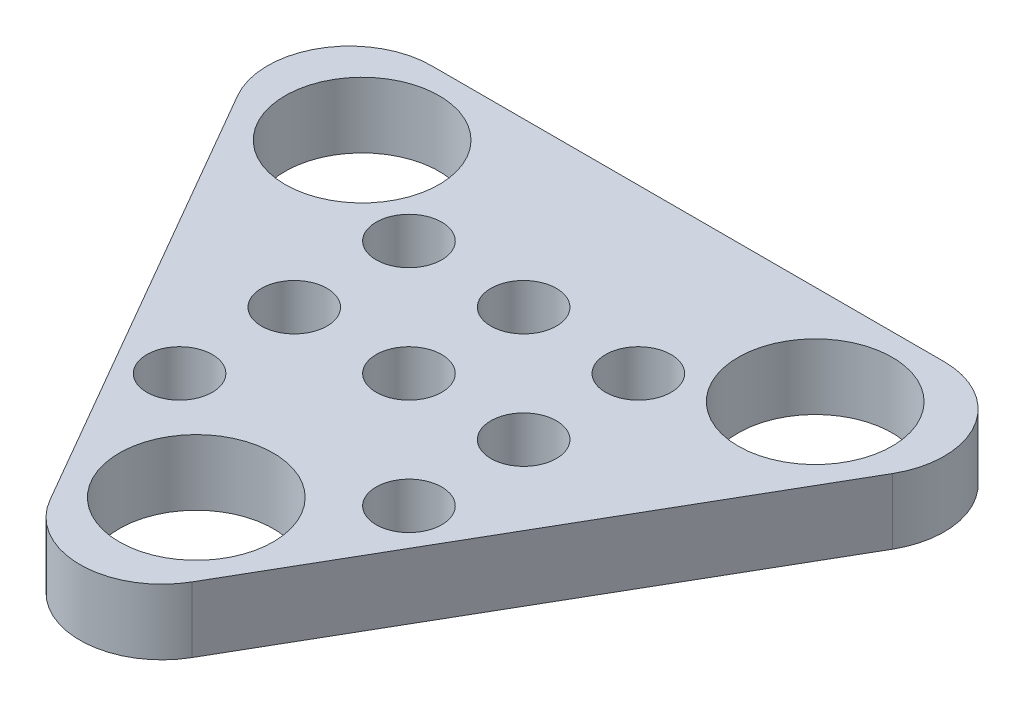
ISO-10303-21;
HEADER;
FILE_DESCRIPTION(('STEP AP214'),'2;1');
FILE_NAME('part.step','',(''),(''),'','','');
FILE_SCHEMA(('AUTOMOTIVE_DESIGN { 1 0 10303 214 1 1 1 1 }'));
ENDSEC;
DATA;
#1=APPLICATION_CONTEXT('core data for automotive mechanical design processes');
#2=APPLICATION_PROTOCOL_DEFINITION('international standard','automotive_design',2000,#1);
#3=PRODUCT_CONTEXT('',#1,'mechanical');
#4=PRODUCT('Part','Part','',(#3));
#5=PRODUCT_RELATED_PRODUCT_CATEGORY('part','',(#4));
#6=PRODUCT_DEFINITION_FORMATION('','',#4);
#7=PRODUCT_DEFINITION_CONTEXT('part definition',#1,'design');
#8=PRODUCT_DEFINITION('design','',#6,#7);
#9=PRODUCT_DEFINITION_SHAPE('','',#8);
#10=(LENGTH_UNIT() NAMED_UNIT(*) SI_UNIT(.MILLI.,.METRE.));
#11=(NAMED_UNIT(*) PLANE_ANGLE_UNIT() SI_UNIT($,.RADIAN.));
#12=(NAMED_UNIT(*) SI_UNIT($,.STERADIAN.) SOLID_ANGLE_UNIT());
#13=UNCERTAINTY_MEASURE_WITH_UNIT(LENGTH_MEASURE(1.E-05),#10,'distance_accuracy_value','');
#14=(GEOMETRIC_REPRESENTATION_CONTEXT(3) GLOBAL_UNCERTAINTY_ASSIGNED_CONTEXT((#13)) GLOBAL_UNIT_ASSIGNED_CONTEXT((#10,
#11,#12)) REPRESENTATION_CONTEXT('',''));
#15=CARTESIAN_POINT('',(0.,0.,0.));
#16=DIRECTION('',(0.,0.,1.));
#17=DIRECTION('',(1.,0.,0.));
#18=AXIS2_PLACEMENT_3D('',#15,#16,#17);
#19=CARTESIAN_POINT('',(-3.0209776379957,2.,-4.56619239929004));
#20=DIRECTION('',(0.,-1.,0.));
#21=DIRECTION('',(0.,0.,-1.));
#22=AXIS2_PLACEMENT_3D('',#19,#20,#21);
#23=PLANE('',#22);
#24=CARTESIAN_POINT('',(1.27033463203907,2.,4.91139789499105));
#25=DIRECTION('',(0.,1.,0.));
#26=DIRECTION('',(0.,0.,1.));
#27=AXIS2_PLACEMENT_3D('',#24,#25,#26);
#28=CIRCLE('',#27,0.999999999999769);
#29=CARTESIAN_POINT('',(1.27033463203907,2.,5.91139789499082));
#30=VERTEX_POINT('',#29);
#31=EDGE_CURVE('E216',#30,#30,#28,.T.);
#32=ORIENTED_EDGE('',*,*,#31,.F.);
#33=EDGE_LOOP('',(#32));
#34=FACE_BOUND('',#33,.T.);
#35=CARTESIAN_POINT('',(4.77033463203904,2.,1.41139789499105));
#36=DIRECTION('',(0.,1.,0.));
#37=DIRECTION('',(0.,0.,1.));
#38=AXIS2_PLACEMENT_3D('',#35,#36,#37);
#39=CIRCLE('',#38,0.999999999999769);
#40=CARTESIAN_POINT('',(4.77033463203904,2.,2.41139789499082));
#41=VERTEX_POINT('',#40);
#42=EDGE_CURVE('E228',#41,#41,#39,.T.);
#43=ORIENTED_EDGE('',*,*,#42,.F.);
#44=EDGE_LOOP('',(#43));
#45=FACE_BOUND('',#44,.T.);
#46=CARTESIAN_POINT('',(8.270334632039,2.,-2.08860210500895));
#47=DIRECTION('',(0.,1.,0.));
#48=DIRECTION('',(0.,0.,1.));
#49=AXIS2_PLACEMENT_3D('',#46,#47,#48);
#50=CIRCLE('',#49,0.999999999999769);
#51=CARTESIAN_POINT('',(8.270334632039,2.,-1.08860210500918));
#52=VERTEX_POINT('',#51);
#53=EDGE_CURVE('E240',#52,#52,#50,.T.);
#54=ORIENTED_EDGE('',*,*,#53,.F.);
#55=EDGE_LOOP('',(#54));
#56=FACE_BOUND('',#55,.T.);
#57=CARTESIAN_POINT('',(1.270334632039,2.,-2.08860210500895));
#58=DIRECTION('',(0.,1.,0.));
#59=DIRECTION('',(0.,0.,1.));
#60=AXIS2_PLACEMENT_3D('',#57,#58,#59);
#61=CIRCLE('',#60,0.999999999999769);
#62=CARTESIAN_POINT('',(1.270334632039,2.,-1.08860210500918));
#63=VERTEX_POINT('',#62);
#64=EDGE_CURVE('E252',#63,#63,#61,.T.);
#65=ORIENTED_EDGE('',*,*,#64,.F.);
#66=EDGE_LOOP('',(#65));
#67=FACE_BOUND('',#66,.T.);
#68=CARTESIAN_POINT('',(4.80279534308235,2.,7.93380760071011));
#69=DIRECTION('',(0.,1.,0.));
#70=DIRECTION('',(0.,0.,1.));
#71=AXIS2_PLACEMENT_3D('',#68,#69,#70);
#72=CIRCLE('',#71,2.34999999999962);
#73=CARTESIAN_POINT('',(4.80279534308235,2.,10.2838076007097));
#74=VERTEX_POINT('',#73);
#75=EDGE_CURVE('E264',#74,#74,#72,.T.);
#76=ORIENTED_EDGE('',*,*,#75,.F.);
#77=EDGE_LOOP('',(#76));
#78=FACE_BOUND('',#77,.T.);
#79=CARTESIAN_POINT('',(-3.0209776379957,2.,-4.56619239929004));
#80=DIRECTION('',(0.,1.,0.));
#81=DIRECTION('',(0.,0.,-1.));
#82=AXIS2_PLACEMENT_3D('',#79,#80,#81);
#83=CIRCLE('',#82,2.49999999999978);
#84=CARTESIAN_POINT('',(-3.02097763799564,2.,-7.0661923992899));
#85=VERTEX_POINT('',#84);
#86=CARTESIAN_POINT('',(-5.18604114745654,2.,-3.31619239929019));
#87=VERTEX_POINT('',#86);
#88=EDGE_CURVE('E127',#85,#87,#83,.T.);
#89=ORIENTED_EDGE('',*,*,#88,.T.);
#90=DIRECTION('',(0.500000000000009,0.,0.866025403784433));
#91=VECTOR('',#90,1.);
#92=CARTESIAN_POINT('',(-5.18604114745654,2.,-3.31619239929019));
#93=LINE('',#92,#91);
#94=CARTESIAN_POINT('',(2.63773183362179,2.,10.2349799108218));
#95=VERTEX_POINT('',#94);
#96=EDGE_CURVE('E85',#87,#95,#93,.T.);
#97=ORIENTED_EDGE('',*,*,#96,.T.);
#98=CARTESIAN_POINT('',(4.80279534308263,2.,8.98497991082193));
#99=DIRECTION('',(0.,1.,0.));
#100=DIRECTION('',(0.,0.,-1.));
#101=AXIS2_PLACEMENT_3D('',#98,#99,#100);
#102=CIRCLE('',#101,2.49999999999976);
#103=CARTESIAN_POINT('',(6.96785885254355,2.,10.2349799108217));
#104=VERTEX_POINT('',#103);
#105=EDGE_CURVE('E98',#95,#104,#102,.T.);
#106=ORIENTED_EDGE('',*,*,#105,.T.);
#107=DIRECTION('',(0.500000000000006,0.,-0.866025403784435));
#108=VECTOR('',#107,1.);
#109=CARTESIAN_POINT('',(6.9678588525436,2.,10.2349799108218));
#110=LINE('',#109,#108);
#111=CARTESIAN_POINT('',(14.7916318336219,2.,-3.3161923992902));
#112=VERTEX_POINT('',#111);
#113=EDGE_CURVE('E92',#104,#112,#110,.T.);
#114=ORIENTED_EDGE('',*,*,#113,.T.);
#115=CARTESIAN_POINT('',(12.6265683241609,2.,-4.56619239929004));
#116=DIRECTION('',(0.,1.,0.));
#117=DIRECTION('',(0.,0.,1.));
#118=AXIS2_PLACEMENT_3D('',#115,#116,#117);
#119=CIRCLE('',#118,2.49999999999983);
#120=CARTESIAN_POINT('',(12.626568324161,2.,-7.06619239928987));
#121=VERTEX_POINT('',#120);
#122=EDGE_CURVE('E96',#112,#121,#119,.T.);
#123=ORIENTED_EDGE('',*,*,#122,.T.);
#124=DIRECTION('',(-1.,0.,0.));
#125=VECTOR('',#124,1.);
#126=CARTESIAN_POINT('',(12.626568324161,2.,-7.0661923992899));
#127=LINE('',#126,#125);
#128=EDGE_CURVE('E48',#121,#85,#127,.T.);
#129=ORIENTED_EDGE('',*,*,#128,.T.);
#130=EDGE_LOOP('',(#89,#97,#106,#114,#123,#129));
#131=FACE_BOUND('',#130,.T.);
#132=CARTESIAN_POINT('',(-2.11063571368384,2.,-4.04060624423422));
#133=DIRECTION('',(0.,1.,0.));
#134=DIRECTION('',(0.,0.,1.));
#135=AXIS2_PLACEMENT_3D('',#132,#133,#134);
#136=CIRCLE('',#135,2.34999999999933);
#137=CARTESIAN_POINT('',(-2.11063571368384,2.,-1.69060624423489));
#138=VERTEX_POINT('',#137);
#139=EDGE_CURVE('E120',#138,#138,#136,.T.);
#140=ORIENTED_EDGE('',*,*,#139,.F.);
#141=EDGE_LOOP('',(#140));
#142=FACE_BOUND('',#141,.T.);
#143=CARTESIAN_POINT('',(11.7162263998492,2.,-4.04060624423421));
#144=DIRECTION('',(0.,1.,0.));
#145=DIRECTION('',(0.,0.,1.));
#146=AXIS2_PLACEMENT_3D('',#143,#144,#145);
#147=CIRCLE('',#146,2.34999999999945);
#148=CARTESIAN_POINT('',(11.7162263998492,2.,-1.69060624423475));
#149=VERTEX_POINT('',#148);
#150=EDGE_CURVE('E258',#149,#149,#147,.T.);
#151=ORIENTED_EDGE('',*,*,#150,.F.);
#152=EDGE_LOOP('',(#151));
#153=FACE_BOUND('',#152,.T.);
#154=CARTESIAN_POINT('',(4.770334632039,2.,-2.08860210500895));
#155=DIRECTION('',(0.,1.,0.));
#156=DIRECTION('',(0.,0.,1.));
#157=AXIS2_PLACEMENT_3D('',#154,#155,#156);
#158=CIRCLE('',#157,0.999999999999769);
#159=CARTESIAN_POINT('',(4.770334632039,2.,-1.08860210500918));
#160=VERTEX_POINT('',#159);
#161=EDGE_CURVE('E246',#160,#160,#158,.T.);
#162=ORIENTED_EDGE('',*,*,#161,.F.);
#163=EDGE_LOOP('',(#162));
#164=FACE_BOUND('',#163,.T.);
#165=CARTESIAN_POINT('',(1.27033463203904,2.,1.41139789499105));
#166=DIRECTION('',(0.,1.,0.));
#167=DIRECTION('',(0.,0.,1.));
#168=AXIS2_PLACEMENT_3D('',#165,#166,#167);
#169=CIRCLE('',#168,0.999999999999769);
#170=CARTESIAN_POINT('',(1.27033463203904,2.,2.41139789499082));
#171=VERTEX_POINT('',#170);
#172=EDGE_CURVE('E234',#171,#171,#169,.T.);
#173=ORIENTED_EDGE('',*,*,#172,.F.);
#174=EDGE_LOOP('',(#173));
#175=FACE_BOUND('',#174,.T.);
#176=CARTESIAN_POINT('',(8.27033463203903,2.,1.41139789499105));
#177=DIRECTION('',(0.,1.,0.));
#178=DIRECTION('',(0.,0.,1.));
#179=AXIS2_PLACEMENT_3D('',#176,#177,#178);
#180=CIRCLE('',#179,0.99999999999977);
#181=CARTESIAN_POINT('',(8.27033463203903,2.,2.41139789499083));
#182=VERTEX_POINT('',#181);
#183=EDGE_CURVE('E222',#182,#182,#180,.T.);
#184=ORIENTED_EDGE('',*,*,#183,.F.);
#185=EDGE_LOOP('',(#184));
#186=FACE_BOUND('',#185,.T.);
#187=CARTESIAN_POINT('',(8.27033463203907,2.,4.91139789499105));
#188=DIRECTION('',(0.,1.,0.));
#189=DIRECTION('',(0.,0.,1.));
#190=AXIS2_PLACEMENT_3D('',#187,#188,#189);
#191=CIRCLE('',#190,0.99999999999977);
#192=CARTESIAN_POINT('',(8.27033463203907,2.,5.91139789499083));
#193=VERTEX_POINT('',#192);
#194=EDGE_CURVE('E207',#193,#193,#191,.T.);
#195=ORIENTED_EDGE('',*,*,#194,.F.);
#196=EDGE_LOOP('',(#195));
#197=FACE_BOUND('',#196,.T.);
#198=ADVANCED_FACE('F31',(#34,#45,#56,#67,#78,#131,#142,#153,#164,#175,#186,#197),#23,.F.);
#199=CARTESIAN_POINT('',(-3.0209776379957,0.,-4.56619239929004));
#200=DIRECTION('',(0.,-1.,0.));
#201=DIRECTION('',(0.,0.,-1.));
#202=AXIS2_PLACEMENT_3D('',#199,#200,#201);
#203=PLANE('',#202);
#204=CARTESIAN_POINT('',(1.27033463203907,0.,4.91139789499105));
#205=DIRECTION('',(0.,1.,0.));
#206=DIRECTION('',(0.,0.,1.));
#207=AXIS2_PLACEMENT_3D('',#204,#205,#206);
#208=CIRCLE('',#207,0.999999999999769);
#209=CARTESIAN_POINT('',(1.27033463203907,0.,5.91139789499082));
#210=VERTEX_POINT('',#209);
#211=EDGE_CURVE('E213',#210,#210,#208,.T.);
#212=ORIENTED_EDGE('',*,*,#211,.T.);
#213=EDGE_LOOP('',(#212));
#214=FACE_BOUND('',#213,.T.);
#215=CARTESIAN_POINT('',(4.77033463203904,0.,1.41139789499105));
#216=DIRECTION('',(0.,1.,0.));
#217=DIRECTION('',(0.,0.,1.));
#218=AXIS2_PLACEMENT_3D('',#215,#216,#217);
#219=CIRCLE('',#218,0.999999999999769);
#220=CARTESIAN_POINT('',(4.77033463203904,0.,2.41139789499082));
#221=VERTEX_POINT('',#220);
#222=EDGE_CURVE('E225',#221,#221,#219,.T.);
#223=ORIENTED_EDGE('',*,*,#222,.T.);
#224=EDGE_LOOP('',(#223));
#225=FACE_BOUND('',#224,.T.);
#226=CARTESIAN_POINT('',(8.270334632039,0.,-2.08860210500895));
#227=DIRECTION('',(0.,1.,0.));
#228=DIRECTION('',(0.,0.,1.));
#229=AXIS2_PLACEMENT_3D('',#226,#227,#228);
#230=CIRCLE('',#229,0.999999999999769);
#231=CARTESIAN_POINT('',(8.270334632039,0.,-1.08860210500918));
#232=VERTEX_POINT('',#231);
#233=EDGE_CURVE('E237',#232,#232,#230,.T.);
#234=ORIENTED_EDGE('',*,*,#233,.T.);
#235=EDGE_LOOP('',(#234));
#236=FACE_BOUND('',#235,.T.);
#237=CARTESIAN_POINT('',(1.270334632039,0.,-2.08860210500895));
#238=DIRECTION('',(0.,1.,0.));
#239=DIRECTION('',(0.,0.,1.));
#240=AXIS2_PLACEMENT_3D('',#237,#238,#239);
#241=CIRCLE('',#240,0.999999999999769);
#242=CARTESIAN_POINT('',(1.270334632039,0.,-1.08860210500918));
#243=VERTEX_POINT('',#242);
#244=EDGE_CURVE('E249',#243,#243,#241,.T.);
#245=ORIENTED_EDGE('',*,*,#244,.T.);
#246=EDGE_LOOP('',(#245));
#247=FACE_BOUND('',#246,.T.);
#248=CARTESIAN_POINT('',(4.80279534308235,0.,7.93380760071011));
#249=DIRECTION('',(0.,1.,0.));
#250=DIRECTION('',(0.,0.,1.));
#251=AXIS2_PLACEMENT_3D('',#248,#249,#250);
#252=CIRCLE('',#251,2.34999999999962);
#253=CARTESIAN_POINT('',(4.80279534308235,0.,10.2838076007097));
#254=VERTEX_POINT('',#253);
#255=EDGE_CURVE('E261',#254,#254,#252,.T.);
#256=ORIENTED_EDGE('',*,*,#255,.T.);
#257=EDGE_LOOP('',(#256));
#258=FACE_BOUND('',#257,.T.);
#259=CARTESIAN_POINT('',(-3.0209776379957,0.,-4.56619239929004));
#260=DIRECTION('',(0.,1.,0.));
#261=DIRECTION('',(0.,0.,-1.));
#262=AXIS2_PLACEMENT_3D('',#259,#260,#261);
#263=CIRCLE('',#262,2.49999999999978);
#264=CARTESIAN_POINT('',(-3.02097763799564,0.,-7.0661923992899));
#265=VERTEX_POINT('',#264);
#266=CARTESIAN_POINT('',(-5.18604114745654,0.,-3.31619239929019));
#267=VERTEX_POINT('',#266);
#268=EDGE_CURVE('E116',#265,#267,#263,.T.);
#269=ORIENTED_EDGE('',*,*,#268,.F.);
#270=DIRECTION('',(-1.,0.,0.));
#271=VECTOR('',#270,1.);
#272=CARTESIAN_POINT('',(12.626568324161,0.,-7.0661923992899));
#273=LINE('',#272,#271);
#274=CARTESIAN_POINT('',(12.626568324161,0.,-7.06619239928987));
#275=VERTEX_POINT('',#274);
#276=EDGE_CURVE('E77',#275,#265,#273,.T.);
#277=ORIENTED_EDGE('',*,*,#276,.F.);
#278=CARTESIAN_POINT('',(12.6265683241609,0.,-4.56619239929004));
#279=DIRECTION('',(0.,1.,0.));
#280=DIRECTION('',(0.,0.,1.));
#281=AXIS2_PLACEMENT_3D('',#278,#279,#280);
#282=CIRCLE('',#281,2.49999999999983);
#283=CARTESIAN_POINT('',(14.7916318336219,0.,-3.3161923992902));
#284=VERTEX_POINT('',#283);
#285=EDGE_CURVE('E71',#284,#275,#282,.T.);
#286=ORIENTED_EDGE('',*,*,#285,.F.);
#287=DIRECTION('',(0.500000000000006,0.,-0.866025403784435));
#288=VECTOR('',#287,1.);
#289=CARTESIAN_POINT('',(6.9678588525436,0.,10.2349799108218));
#290=LINE('',#289,#288);
#291=CARTESIAN_POINT('',(6.96785885254355,0.,10.2349799108217));
#292=VERTEX_POINT('',#291);
#293=EDGE_CURVE('E106',#292,#284,#290,.T.);
#294=ORIENTED_EDGE('',*,*,#293,.F.);
#295=CARTESIAN_POINT('',(4.80279534308263,0.,8.98497991082193));
#296=DIRECTION('',(0.,1.,0.));
#297=DIRECTION('',(0.,0.,-1.));
#298=AXIS2_PLACEMENT_3D('',#295,#296,#297);
#299=CIRCLE('',#298,2.49999999999976);
#300=CARTESIAN_POINT('',(2.63773183362179,0.,10.2349799108218));
#301=VERTEX_POINT('',#300);
#302=EDGE_CURVE('E122',#301,#292,#299,.T.);
#303=ORIENTED_EDGE('',*,*,#302,.F.);
#304=DIRECTION('',(0.500000000000009,0.,0.866025403784433));
#305=VECTOR('',#304,1.);
#306=CARTESIAN_POINT('',(-5.18604114745654,0.,-3.31619239929019));
#307=LINE('',#306,#305);
#308=EDGE_CURVE('E119',#267,#301,#307,.T.);
#309=ORIENTED_EDGE('',*,*,#308,.F.);
#310=EDGE_LOOP('',(#269,#277,#286,#294,#303,#309));
#311=FACE_BOUND('',#310,.T.);
#312=CARTESIAN_POINT('',(-2.11063571368384,0.,-4.04060624423422));
#313=DIRECTION('',(0.,1.,0.));
#314=DIRECTION('',(0.,0.,1.));
#315=AXIS2_PLACEMENT_3D('',#312,#313,#314);
#316=CIRCLE('',#315,2.34999999999933);
#317=CARTESIAN_POINT('',(-2.11063571368384,0.,-1.69060624423489));
#318=VERTEX_POINT('',#317);
#319=EDGE_CURVE('E267',#318,#318,#316,.T.);
#320=ORIENTED_EDGE('',*,*,#319,.T.);
#321=EDGE_LOOP('',(#320));
#322=FACE_BOUND('',#321,.T.);
#323=CARTESIAN_POINT('',(11.7162263998492,0.,-4.04060624423421));
#324=DIRECTION('',(0.,1.,0.));
#325=DIRECTION('',(0.,0.,1.));
#326=AXIS2_PLACEMENT_3D('',#323,#324,#325);
#327=CIRCLE('',#326,2.34999999999945);
#328=CARTESIAN_POINT('',(11.7162263998492,0.,-1.69060624423475));
#329=VERTEX_POINT('',#328);
#330=EDGE_CURVE('E255',#329,#329,#327,.T.);
#331=ORIENTED_EDGE('',*,*,#330,.T.);
#332=EDGE_LOOP('',(#331));
#333=FACE_BOUND('',#332,.T.);
#334=CARTESIAN_POINT('',(4.770334632039,0.,-2.08860210500895));
#335=DIRECTION('',(0.,1.,0.));
#336=DIRECTION('',(0.,0.,1.));
#337=AXIS2_PLACEMENT_3D('',#334,#335,#336);
#338=CIRCLE('',#337,0.999999999999769);
#339=CARTESIAN_POINT('',(4.770334632039,0.,-1.08860210500918));
#340=VERTEX_POINT('',#339);
#341=EDGE_CURVE('E243',#340,#340,#338,.T.);
#342=ORIENTED_EDGE('',*,*,#341,.T.);
#343=EDGE_LOOP('',(#342));
#344=FACE_BOUND('',#343,.T.);
#345=CARTESIAN_POINT('',(1.27033463203904,0.,1.41139789499105));
#346=DIRECTION('',(0.,1.,0.));
#347=DIRECTION('',(0.,0.,1.));
#348=AXIS2_PLACEMENT_3D('',#345,#346,#347);
#349=CIRCLE('',#348,0.999999999999769);
#350=CARTESIAN_POINT('',(1.27033463203904,0.,2.41139789499082));
#351=VERTEX_POINT('',#350);
#352=EDGE_CURVE('E231',#351,#351,#349,.T.);
#353=ORIENTED_EDGE('',*,*,#352,.T.);
#354=EDGE_LOOP('',(#353));
#355=FACE_BOUND('',#354,.T.);
#356=CARTESIAN_POINT('',(8.27033463203903,0.,1.41139789499105));
#357=DIRECTION('',(0.,1.,0.));
#358=DIRECTION('',(0.,0.,1.));
#359=AXIS2_PLACEMENT_3D('',#356,#357,#358);
#360=CIRCLE('',#359,0.99999999999977);
#361=CARTESIAN_POINT('',(8.27033463203903,0.,2.41139789499083));
#362=VERTEX_POINT('',#361);
#363=EDGE_CURVE('E219',#362,#362,#360,.T.);
#364=ORIENTED_EDGE('',*,*,#363,.T.);
#365=EDGE_LOOP('',(#364));
#366=FACE_BOUND('',#365,.T.);
#367=CARTESIAN_POINT('',(8.27033463203907,0.,4.91139789499105));
#368=DIRECTION('',(0.,1.,0.));
#369=DIRECTION('',(0.,0.,1.));
#370=AXIS2_PLACEMENT_3D('',#367,#368,#369);
#371=CIRCLE('',#370,0.99999999999977);
#372=CARTESIAN_POINT('',(8.27033463203907,0.,5.91139789499083));
#373=VERTEX_POINT('',#372);
#374=EDGE_CURVE('E210',#373,#373,#371,.T.);
#375=ORIENTED_EDGE('',*,*,#374,.T.);
#376=EDGE_LOOP('',(#375));
#377=FACE_BOUND('',#376,.T.);
#378=ADVANCED_FACE('F136',(#214,#225,#236,#247,#258,#311,#322,#333,#344,#355,#366,#377),#203,.T.);
#379=CARTESIAN_POINT('',(-3.0209776379957,2.,-4.56619239929004));
#380=DIRECTION('',(0.,-1.,0.));
#381=DIRECTION('',(0.,0.,-1.));
#382=AXIS2_PLACEMENT_3D('',#379,#380,#381);
#383=CYLINDRICAL_SURFACE('',#382,2.49999999999978);
#384=ORIENTED_EDGE('',*,*,#268,.T.);
#385=DIRECTION('',(0.,-1.,0.));
#386=VECTOR('',#385,1.);
#387=CARTESIAN_POINT('',(-5.18604114745654,2.,-3.31619239929019));
#388=LINE('',#387,#386);
#389=EDGE_CURVE('E11',#87,#267,#388,.T.);
#390=ORIENTED_EDGE('',*,*,#389,.F.);
#391=ORIENTED_EDGE('',*,*,#88,.F.);
#392=DIRECTION('',(0.,-1.,0.));
#393=VECTOR('',#392,1.);
#394=CARTESIAN_POINT('',(-3.02097763799564,2.,-7.0661923992899));
#395=LINE('',#394,#393);
#396=EDGE_CURVE('E112',#85,#265,#395,.T.);
#397=ORIENTED_EDGE('',*,*,#396,.T.);
#398=EDGE_LOOP('',(#384,#390,#391,#397));
#399=FACE_BOUND('',#398,.T.);
#400=ADVANCED_FACE('F33',(#399),#383,.T.);
#401=CARTESIAN_POINT('',(-5.18604114745654,2.,-3.31619239929019));
#402=DIRECTION('',(0.866025403784433,0.,-0.500000000000009));
#403=DIRECTION('',(-0.500000000000009,0.,-0.866025403784434));
#404=AXIS2_PLACEMENT_3D('',#401,#402,#403);
#405=PLANE('',#404);
#406=ORIENTED_EDGE('',*,*,#308,.T.);
#407=DIRECTION('',(0.,-1.,0.));
#408=VECTOR('',#407,1.);
#409=CARTESIAN_POINT('',(2.63773183362179,2.,10.2349799108218));
#410=LINE('',#409,#408);
#411=EDGE_CURVE('E40',#95,#301,#410,.T.);
#412=ORIENTED_EDGE('',*,*,#411,.F.);
#413=ORIENTED_EDGE('',*,*,#96,.F.);
#414=ORIENTED_EDGE('',*,*,#389,.T.);
#415=EDGE_LOOP('',(#406,#412,#413,#414));
#416=FACE_BOUND('',#415,.T.);
#417=ADVANCED_FACE('F387',(#416),#405,.F.);
#418=CARTESIAN_POINT('',(4.80279534308263,2.,8.98497991082193));
#419=DIRECTION('',(0.,-1.,0.));
#420=DIRECTION('',(0.,0.,-1.));
#421=AXIS2_PLACEMENT_3D('',#418,#419,#420);
#422=CYLINDRICAL_SURFACE('',#421,2.49999999999976);
#423=ORIENTED_EDGE('',*,*,#302,.T.);
#424=DIRECTION('',(0.,-1.,0.));
#425=VECTOR('',#424,1.);
#426=CARTESIAN_POINT('',(6.96785885254355,2.,10.2349799108217));
#427=LINE('',#426,#425);
#428=EDGE_CURVE('E107',#104,#292,#427,.T.);
#429=ORIENTED_EDGE('',*,*,#428,.F.);
#430=ORIENTED_EDGE('',*,*,#105,.F.);
#431=ORIENTED_EDGE('',*,*,#411,.T.);
#432=EDGE_LOOP('',(#423,#429,#430,#431));
#433=FACE_BOUND('',#432,.T.);
#434=ADVANCED_FACE('F133',(#433),#422,.T.);
#435=CARTESIAN_POINT('',(6.9678588525436,2.,10.2349799108218));
#436=DIRECTION('',(-0.866025403784435,0.,-0.500000000000006));
#437=DIRECTION('',(-0.500000000000006,0.,0.866025403784435));
#438=AXIS2_PLACEMENT_3D('',#435,#436,#437);
#439=PLANE('',#438);
#440=ORIENTED_EDGE('',*,*,#293,.T.);
#441=DIRECTION('',(0.,-1.,0.));
#442=VECTOR('',#441,1.);
#443=CARTESIAN_POINT('',(14.7916318336219,2.,-3.3161923992902));
#444=LINE('',#443,#442);
#445=EDGE_CURVE('E103',#112,#284,#444,.T.);
#446=ORIENTED_EDGE('',*,*,#445,.F.);
#447=ORIENTED_EDGE('',*,*,#113,.F.);
#448=ORIENTED_EDGE('',*,*,#428,.T.);
#449=EDGE_LOOP('',(#440,#446,#447,#448));
#450=FACE_BOUND('',#449,.T.);
#451=ADVANCED_FACE('F104',(#450),#439,.F.);
#452=CARTESIAN_POINT('',(12.6265683241609,2.,-4.56619239929004));
#453=DIRECTION('',(0.,-1.,0.));
#454=DIRECTION('',(0.,0.,-1.));
#455=AXIS2_PLACEMENT_3D('',#452,#453,#454);
#456=CYLINDRICAL_SURFACE('',#455,2.49999999999983);
#457=ORIENTED_EDGE('',*,*,#285,.T.);
#458=DIRECTION('',(0.,-1.,0.));
#459=VECTOR('',#458,1.);
#460=CARTESIAN_POINT('',(12.626568324161,2.,-7.06619239928987));
#461=LINE('',#460,#459);
#462=EDGE_CURVE('E108',#121,#275,#461,.T.);
#463=ORIENTED_EDGE('',*,*,#462,.F.);
#464=ORIENTED_EDGE('',*,*,#122,.F.);
#465=ORIENTED_EDGE('',*,*,#445,.T.);
#466=EDGE_LOOP('',(#457,#463,#464,#465));
#467=FACE_BOUND('',#466,.T.);
#468=ADVANCED_FACE('F110',(#467),#456,.T.);
#469=CARTESIAN_POINT('',(12.626568324161,2.,-7.0661923992899));
#470=DIRECTION('',(0.,0.,1.));
#471=DIRECTION('',(1.,0.,0.));
#472=AXIS2_PLACEMENT_3D('',#469,#470,#471);
#473=PLANE('',#472);
#474=ORIENTED_EDGE('',*,*,#276,.T.);
#475=ORIENTED_EDGE('',*,*,#396,.F.);
#476=ORIENTED_EDGE('',*,*,#128,.F.);
#477=ORIENTED_EDGE('',*,*,#462,.T.);
#478=EDGE_LOOP('',(#474,#475,#476,#477));
#479=FACE_BOUND('',#478,.T.);
#480=ADVANCED_FACE('F141',(#479),#473,.F.);
#481=CARTESIAN_POINT('',(-2.11063571368384,2.,-4.04060624423422));
#482=DIRECTION('',(0.,-1.,0.));
#483=DIRECTION('',(0.,0.,-1.));
#484=AXIS2_PLACEMENT_3D('',#481,#482,#483);
#485=CYLINDRICAL_SURFACE('',#484,2.34999999999933);
#486=ORIENTED_EDGE('',*,*,#139,.T.);
#487=EDGE_LOOP('',(#486));
#488=FACE_BOUND('',#487,.T.);
#489=ORIENTED_EDGE('',*,*,#319,.F.);
#490=EDGE_LOOP('',(#489));
#491=FACE_BOUND('',#490,.T.);
#492=ADVANCED_FACE('F143',(#488,#491),#485,.F.);
#493=CARTESIAN_POINT('',(4.80279534308235,2.,7.93380760071011));
#494=DIRECTION('',(0.,-1.,0.));
#495=DIRECTION('',(0.,0.,-1.));
#496=AXIS2_PLACEMENT_3D('',#493,#494,#495);
#497=CYLINDRICAL_SURFACE('',#496,2.34999999999962);
#498=ORIENTED_EDGE('',*,*,#75,.T.);
#499=EDGE_LOOP('',(#498));
#500=FACE_BOUND('',#499,.T.);
#501=ORIENTED_EDGE('',*,*,#255,.F.);
#502=EDGE_LOOP('',(#501));
#503=FACE_BOUND('',#502,.T.);
#504=ADVANCED_FACE('F149',(#500,#503),#497,.F.);
#505=CARTESIAN_POINT('',(11.7162263998492,2.,-4.04060624423421));
#506=DIRECTION('',(0.,-1.,0.));
#507=DIRECTION('',(0.,0.,-1.));
#508=AXIS2_PLACEMENT_3D('',#505,#506,#507);
#509=CYLINDRICAL_SURFACE('',#508,2.34999999999945);
#510=ORIENTED_EDGE('',*,*,#150,.T.);
#511=EDGE_LOOP('',(#510));
#512=FACE_BOUND('',#511,.T.);
#513=ORIENTED_EDGE('',*,*,#330,.F.);
#514=EDGE_LOOP('',(#513));
#515=FACE_BOUND('',#514,.T.);
#516=ADVANCED_FACE('F166',(#512,#515),#509,.F.);
#517=CARTESIAN_POINT('',(1.270334632039,2.,-2.08860210500895));
#518=DIRECTION('',(0.,-1.,0.));
#519=DIRECTION('',(0.,0.,-1.));
#520=AXIS2_PLACEMENT_3D('',#517,#518,#519);
#521=CYLINDRICAL_SURFACE('',#520,0.999999999999769);
#522=ORIENTED_EDGE('',*,*,#64,.T.);
#523=EDGE_LOOP('',(#522));
#524=FACE_BOUND('',#523,.T.);
#525=ORIENTED_EDGE('',*,*,#244,.F.);
#526=EDGE_LOOP('',(#525));
#527=FACE_BOUND('',#526,.T.);
#528=ADVANCED_FACE('F170',(#524,#527),#521,.F.);
#529=CARTESIAN_POINT('',(4.770334632039,2.,-2.08860210500895));
#530=DIRECTION('',(0.,-1.,0.));
#531=DIRECTION('',(0.,0.,-1.));
#532=AXIS2_PLACEMENT_3D('',#529,#530,#531);
#533=CYLINDRICAL_SURFACE('',#532,0.999999999999769);
#534=ORIENTED_EDGE('',*,*,#161,.T.);
#535=EDGE_LOOP('',(#534));
#536=FACE_BOUND('',#535,.T.);
#537=ORIENTED_EDGE('',*,*,#341,.F.);
#538=EDGE_LOOP('',(#537));
#539=FACE_BOUND('',#538,.T.);
#540=ADVANCED_FACE('F174',(#536,#539),#533,.F.);
#541=CARTESIAN_POINT('',(8.270334632039,2.,-2.08860210500895));
#542=DIRECTION('',(0.,-1.,0.));
#543=DIRECTION('',(0.,0.,-1.));
#544=AXIS2_PLACEMENT_3D('',#541,#542,#543);
#545=CYLINDRICAL_SURFACE('',#544,0.999999999999769);
#546=ORIENTED_EDGE('',*,*,#53,.T.);
#547=EDGE_LOOP('',(#546));
#548=FACE_BOUND('',#547,.T.);
#549=ORIENTED_EDGE('',*,*,#233,.F.);
#550=EDGE_LOOP('',(#549));
#551=FACE_BOUND('',#550,.T.);
#552=ADVANCED_FACE('F178',(#548,#551),#545,.F.);
#553=CARTESIAN_POINT('',(1.27033463203904,2.,1.41139789499105));
#554=DIRECTION('',(0.,-1.,0.));
#555=DIRECTION('',(0.,0.,-1.));
#556=AXIS2_PLACEMENT_3D('',#553,#554,#555);
#557=CYLINDRICAL_SURFACE('',#556,0.999999999999769);
#558=ORIENTED_EDGE('',*,*,#172,.T.);
#559=EDGE_LOOP('',(#558));
#560=FACE_BOUND('',#559,.T.);
#561=ORIENTED_EDGE('',*,*,#352,.F.);
#562=EDGE_LOOP('',(#561));
#563=FACE_BOUND('',#562,.T.);
#564=ADVANCED_FACE('F182',(#560,#563),#557,.F.);
#565=CARTESIAN_POINT('',(4.77033463203904,2.,1.41139789499105));
#566=DIRECTION('',(0.,-1.,0.));
#567=DIRECTION('',(0.,0.,-1.));
#568=AXIS2_PLACEMENT_3D('',#565,#566,#567);
#569=CYLINDRICAL_SURFACE('',#568,0.999999999999769);
#570=ORIENTED_EDGE('',*,*,#42,.T.);
#571=EDGE_LOOP('',(#570));
#572=FACE_BOUND('',#571,.T.);
#573=ORIENTED_EDGE('',*,*,#222,.F.);
#574=EDGE_LOOP('',(#573));
#575=FACE_BOUND('',#574,.T.);
#576=ADVANCED_FACE('F186',(#572,#575),#569,.F.);
#577=CARTESIAN_POINT('',(8.27033463203903,2.,1.41139789499105));
#578=DIRECTION('',(0.,-1.,0.));
#579=DIRECTION('',(0.,0.,-1.));
#580=AXIS2_PLACEMENT_3D('',#577,#578,#579);
#581=CYLINDRICAL_SURFACE('',#580,0.99999999999977);
#582=ORIENTED_EDGE('',*,*,#183,.T.);
#583=EDGE_LOOP('',(#582));
#584=FACE_BOUND('',#583,.T.);
#585=ORIENTED_EDGE('',*,*,#363,.F.);
#586=EDGE_LOOP('',(#585));
#587=FACE_BOUND('',#586,.T.);
#588=ADVANCED_FACE('F190',(#584,#587),#581,.F.);
#589=CARTESIAN_POINT('',(1.27033463203907,2.,4.91139789499105));
#590=DIRECTION('',(0.,-1.,0.));
#591=DIRECTION('',(0.,0.,-1.));
#592=AXIS2_PLACEMENT_3D('',#589,#590,#591);
#593=CYLINDRICAL_SURFACE('',#592,0.999999999999769);
#594=ORIENTED_EDGE('',*,*,#31,.T.);
#595=EDGE_LOOP('',(#594));
#596=FACE_BOUND('',#595,.T.);
#597=ORIENTED_EDGE('',*,*,#211,.F.);
#598=EDGE_LOOP('',(#597));
#599=FACE_BOUND('',#598,.T.);
#600=ADVANCED_FACE('F194',(#596,#599),#593,.F.);
#601=CARTESIAN_POINT('',(8.27033463203907,2.,4.91139789499105));
#602=DIRECTION('',(0.,-1.,0.));
#603=DIRECTION('',(0.,0.,-1.));
#604=AXIS2_PLACEMENT_3D('',#601,#602,#603);
#605=CYLINDRICAL_SURFACE('',#604,0.99999999999977);
#606=ORIENTED_EDGE('',*,*,#194,.T.);
#607=EDGE_LOOP('',(#606));
#608=FACE_BOUND('',#607,.T.);
#609=ORIENTED_EDGE('',*,*,#374,.F.);
#610=EDGE_LOOP('',(#609));
#611=FACE_BOUND('',#610,.T.);
#612=ADVANCED_FACE('F198',(#608,#611),#605,.F.);
#613=CLOSED_SHELL('',(#198,#378,#400,#417,#434,#451,#468,#480,#492,#504,#516,#528,#540,#552,
#564,#576,#588,#600,#612));
#614=MANIFOLD_SOLID_BREP('B2',#613);
#615=ADVANCED_BREP_SHAPE_REPRESENTATION('',(#18,#614),#14);
#616=SHAPE_DEFINITION_REPRESENTATION(#9,#615);
ENDSEC;
END-ISO-10303-21;
